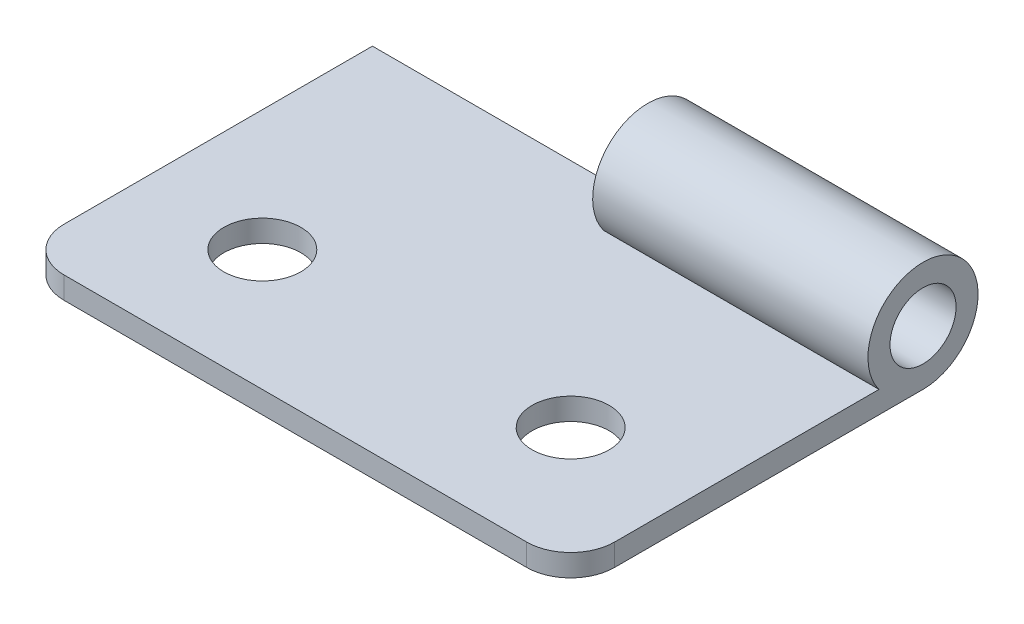
ISO-10303-21;
HEADER;
FILE_DESCRIPTION(('STEP AP214'),'2;1');
FILE_NAME('part.step','',(''),(''),'','','');
FILE_SCHEMA(('AUTOMOTIVE_DESIGN { 1 0 10303 214 1 1 1 1 }'));
ENDSEC;
DATA;
#1=APPLICATION_CONTEXT('core data for automotive mechanical design processes');
#2=APPLICATION_PROTOCOL_DEFINITION('international standard','automotive_design',2000,#1);
#3=PRODUCT_CONTEXT('',#1,'mechanical');
#4=PRODUCT('Part','Part','',(#3));
#5=PRODUCT_RELATED_PRODUCT_CATEGORY('part','',(#4));
#6=PRODUCT_DEFINITION_FORMATION('','',#4);
#7=PRODUCT_DEFINITION_CONTEXT('part definition',#1,'design');
#8=PRODUCT_DEFINITION('design','',#6,#7);
#9=PRODUCT_DEFINITION_SHAPE('','',#8);
#10=(LENGTH_UNIT() NAMED_UNIT(*) SI_UNIT(.MILLI.,.METRE.));
#11=(NAMED_UNIT(*) PLANE_ANGLE_UNIT() SI_UNIT($,.RADIAN.));
#12=(NAMED_UNIT(*) SI_UNIT($,.STERADIAN.) SOLID_ANGLE_UNIT());
#13=UNCERTAINTY_MEASURE_WITH_UNIT(LENGTH_MEASURE(1.E-05),#10,'distance_accuracy_value','');
#14=(GEOMETRIC_REPRESENTATION_CONTEXT(3) GLOBAL_UNCERTAINTY_ASSIGNED_CONTEXT((#13)) GLOBAL_UNIT_ASSIGNED_CONTEXT((#10,
#11,#12)) REPRESENTATION_CONTEXT('',''));
#15=CARTESIAN_POINT('',(0.,0.,0.));
#16=DIRECTION('',(0.,0.,1.));
#17=DIRECTION('',(1.,0.,0.));
#18=AXIS2_PLACEMENT_3D('',#15,#16,#17);
#19=CARTESIAN_POINT('',(-12.5,1.,-8.));
#20=DIRECTION('',(0.,0.,1.));
#21=DIRECTION('',(1.,0.,0.));
#22=AXIS2_PLACEMENT_3D('',#19,#20,#21);
#23=PLANE('',#22);
#24=DIRECTION('',(0.,1.,0.));
#25=VECTOR('',#24,1.);
#26=CARTESIAN_POINT('',(0.,1.,-8.));
#27=LINE('',#26,#25);
#28=CARTESIAN_POINT('',(0.,0.,-8.));
#29=VERTEX_POINT('',#28);
#30=CARTESIAN_POINT('',(0.,1.,-8.));
#31=VERTEX_POINT('',#30);
#32=EDGE_CURVE('E124',#29,#31,#27,.T.);
#33=ORIENTED_EDGE('',*,*,#32,.F.);
#34=DIRECTION('',(-1.,0.,0.));
#35=VECTOR('',#34,1.);
#36=CARTESIAN_POINT('',(-12.5,0.,-8.));
#37=LINE('',#36,#35);
#38=CARTESIAN_POINT('',(-12.5,0.,-8.));
#39=VERTEX_POINT('',#38);
#40=EDGE_CURVE('E108',#29,#39,#37,.T.);
#41=ORIENTED_EDGE('',*,*,#40,.T.);
#42=DIRECTION('',(0.,-1.,0.));
#43=VECTOR('',#42,1.);
#44=CARTESIAN_POINT('',(-12.5,1.,-8.));
#45=LINE('',#44,#43);
#46=CARTESIAN_POINT('',(-12.5,1.,-8.));
#47=VERTEX_POINT('',#46);
#48=EDGE_CURVE('E184',#47,#39,#45,.T.);
#49=ORIENTED_EDGE('',*,*,#48,.F.);
#50=DIRECTION('',(-1.,0.,0.));
#51=VECTOR('',#50,1.);
#52=CARTESIAN_POINT('',(-12.5,1.,-8.));
#53=LINE('',#52,#51);
#54=EDGE_CURVE('E125',#31,#47,#53,.T.);
#55=ORIENTED_EDGE('',*,*,#54,.F.);
#56=EDGE_LOOP('',(#33,#41,#49,#55));
#57=FACE_BOUND('',#56,.T.);
#58=ADVANCED_FACE('F43',(#57),#23,.F.);
#59=CARTESIAN_POINT('',(12.5,1.,-8.));
#60=DIRECTION('',(-1.,0.,0.));
#61=DIRECTION('',(0.,0.,1.));
#62=AXIS2_PLACEMENT_3D('',#59,#60,#61);
#63=PLANE('',#62);
#64=DIRECTION('',(0.,0.,-1.));
#65=VECTOR('',#64,1.);
#66=CARTESIAN_POINT('',(12.5,1.,-8.));
#67=LINE('',#66,#65);
#68=CARTESIAN_POINT('',(12.5,1.,6.));
#69=VERTEX_POINT('',#68);
#70=CARTESIAN_POINT('',(12.5,1.,-6.));
#71=VERTEX_POINT('',#70);
#72=EDGE_CURVE('E172',#69,#71,#67,.T.);
#73=ORIENTED_EDGE('',*,*,#72,.F.);
#74=DIRECTION('',(0.,-1.,0.));
#75=VECTOR('',#74,1.);
#76=CARTESIAN_POINT('',(12.5,1.,6.));
#77=LINE('',#76,#75);
#78=CARTESIAN_POINT('',(12.5,0.,6.));
#79=VERTEX_POINT('',#78);
#80=EDGE_CURVE('E193',#69,#79,#77,.T.);
#81=ORIENTED_EDGE('',*,*,#80,.T.);
#82=DIRECTION('',(0.,0.,-1.));
#83=VECTOR('',#82,1.);
#84=CARTESIAN_POINT('',(12.5,0.,-8.));
#85=LINE('',#84,#83);
#86=CARTESIAN_POINT('',(12.5,0.,-8.));
#87=VERTEX_POINT('',#86);
#88=EDGE_CURVE('E120',#79,#87,#85,.T.);
#89=ORIENTED_EDGE('',*,*,#88,.T.);
#90=CARTESIAN_POINT('',(12.5,2.5,-8.));
#91=DIRECTION('',(1.,0.,0.));
#92=DIRECTION('',(0.,0.,-1.));
#93=AXIS2_PLACEMENT_3D('',#90,#91,#92);
#94=CIRCLE('',#93,2.5);
#95=EDGE_CURVE('E139',#87,#71,#94,.T.);
#96=ORIENTED_EDGE('',*,*,#95,.T.);
#97=EDGE_LOOP('',(#73,#81,#89,#96));
#98=FACE_BOUND('',#97,.T.);
#99=CARTESIAN_POINT('',(12.5,2.5,-8.));
#100=DIRECTION('',(1.,0.,0.));
#101=DIRECTION('',(0.,0.,-1.));
#102=AXIS2_PLACEMENT_3D('',#99,#100,#101);
#103=CIRCLE('',#102,1.5);
#104=CARTESIAN_POINT('',(12.5,2.5,-9.5));
#105=VERTEX_POINT('',#104);
#106=EDGE_CURVE('E151',#105,#105,#103,.T.);
#107=ORIENTED_EDGE('',*,*,#106,.F.);
#108=EDGE_LOOP('',(#107));
#109=FACE_BOUND('',#108,.T.);
#110=ADVANCED_FACE('F220',(#98,#109),#63,.F.);
#111=CARTESIAN_POINT('',(-12.5,1.,-8.));
#112=DIRECTION('',(1.,0.,0.));
#113=DIRECTION('',(0.,0.,-1.));
#114=AXIS2_PLACEMENT_3D('',#111,#112,#113);
#115=PLANE('',#114);
#116=DIRECTION('',(0.,0.,1.));
#117=VECTOR('',#116,1.);
#118=CARTESIAN_POINT('',(-12.5,0.,-8.));
#119=LINE('',#118,#117);
#120=CARTESIAN_POINT('',(-12.5,0.,6.));
#121=VERTEX_POINT('',#120);
#122=EDGE_CURVE('E115',#39,#121,#119,.T.);
#123=ORIENTED_EDGE('',*,*,#122,.T.);
#124=DIRECTION('',(0.,-1.,0.));
#125=VECTOR('',#124,1.);
#126=CARTESIAN_POINT('',(-12.5,1.,6.));
#127=LINE('',#126,#125);
#128=CARTESIAN_POINT('',(-12.5,1.,6.));
#129=VERTEX_POINT('',#128);
#130=EDGE_CURVE('E11',#121,#129,#127,.F.);
#131=ORIENTED_EDGE('',*,*,#130,.T.);
#132=DIRECTION('',(0.,0.,1.));
#133=VECTOR('',#132,1.);
#134=CARTESIAN_POINT('',(-12.5,1.,-8.));
#135=LINE('',#134,#133);
#136=EDGE_CURVE('E178',#47,#129,#135,.T.);
#137=ORIENTED_EDGE('',*,*,#136,.F.);
#138=ORIENTED_EDGE('',*,*,#48,.T.);
#139=EDGE_LOOP('',(#123,#131,#137,#138));
#140=FACE_BOUND('',#139,.T.);
#141=ADVANCED_FACE('F228',(#140),#115,.F.);
#142=CARTESIAN_POINT('',(-12.5,1.,8.));
#143=DIRECTION('',(0.,0.,-1.));
#144=DIRECTION('',(-1.,0.,0.));
#145=AXIS2_PLACEMENT_3D('',#142,#143,#144);
#146=PLANE('',#145);
#147=DIRECTION('',(1.,0.,0.));
#148=VECTOR('',#147,1.);
#149=CARTESIAN_POINT('',(-12.5,0.,8.));
#150=LINE('',#149,#148);
#151=CARTESIAN_POINT('',(-10.5,0.,8.));
#152=VERTEX_POINT('',#151);
#153=CARTESIAN_POINT('',(10.5,0.,8.));
#154=VERTEX_POINT('',#153);
#155=EDGE_CURVE('E175',#152,#154,#150,.T.);
#156=ORIENTED_EDGE('',*,*,#155,.T.);
#157=DIRECTION('',(0.,-1.,0.));
#158=VECTOR('',#157,1.);
#159=CARTESIAN_POINT('',(10.5,1.,8.));
#160=LINE('',#159,#158);
#161=CARTESIAN_POINT('',(10.5,1.,8.));
#162=VERTEX_POINT('',#161);
#163=EDGE_CURVE('E65',#154,#162,#160,.F.);
#164=ORIENTED_EDGE('',*,*,#163,.T.);
#165=DIRECTION('',(1.,0.,0.));
#166=VECTOR('',#165,1.);
#167=CARTESIAN_POINT('',(-12.5,1.,8.));
#168=LINE('',#167,#166);
#169=CARTESIAN_POINT('',(-10.5,1.,8.));
#170=VERTEX_POINT('',#169);
#171=EDGE_CURVE('E181',#170,#162,#168,.T.);
#172=ORIENTED_EDGE('',*,*,#171,.F.);
#173=DIRECTION('',(0.,-1.,0.));
#174=VECTOR('',#173,1.);
#175=CARTESIAN_POINT('',(-10.5,1.,8.));
#176=LINE('',#175,#174);
#177=EDGE_CURVE('E203',#170,#152,#176,.T.);
#178=ORIENTED_EDGE('',*,*,#177,.T.);
#179=EDGE_LOOP('',(#156,#164,#172,#178));
#180=FACE_BOUND('',#179,.T.);
#181=ADVANCED_FACE('F224',(#180),#146,.F.);
#182=CARTESIAN_POINT('',(0.,1.,0.));
#183=DIRECTION('',(0.,1.,0.));
#184=DIRECTION('',(0.,0.,1.));
#185=AXIS2_PLACEMENT_3D('',#182,#183,#184);
#186=PLANE('',#185);
#187=ORIENTED_EDGE('',*,*,#171,.T.);
#188=CARTESIAN_POINT('',(10.5,1.,6.));
#189=DIRECTION('',(0.,1.,0.));
#190=DIRECTION('',(0.,0.,1.));
#191=AXIS2_PLACEMENT_3D('',#188,#189,#190);
#192=CIRCLE('',#191,2.);
#193=EDGE_CURVE('E52',#162,#69,#192,.T.);
#194=ORIENTED_EDGE('',*,*,#193,.T.);
#195=ORIENTED_EDGE('',*,*,#72,.T.);
#196=DIRECTION('',(1.,0.,0.));
#197=VECTOR('',#196,1.);
#198=CARTESIAN_POINT('',(0.,1.,-6.));
#199=LINE('',#198,#197);
#200=CARTESIAN_POINT('',(0.,1.,-6.));
#201=VERTEX_POINT('',#200);
#202=EDGE_CURVE('E130',#201,#71,#199,.T.);
#203=ORIENTED_EDGE('',*,*,#202,.F.);
#204=DIRECTION('',(0.,0.,-1.));
#205=VECTOR('',#204,1.);
#206=CARTESIAN_POINT('',(0.,1.,0.));
#207=LINE('',#206,#205);
#208=EDGE_CURVE('E131',#201,#31,#207,.T.);
#209=ORIENTED_EDGE('',*,*,#208,.T.);
#210=ORIENTED_EDGE('',*,*,#54,.T.);
#211=ORIENTED_EDGE('',*,*,#136,.T.);
#212=CARTESIAN_POINT('',(-10.5,1.,6.));
#213=DIRECTION('',(0.,1.,0.));
#214=DIRECTION('',(0.,0.,1.));
#215=AXIS2_PLACEMENT_3D('',#212,#213,#214);
#216=CIRCLE('',#215,2.);
#217=EDGE_CURVE('E209',#129,#170,#216,.T.);
#218=ORIENTED_EDGE('',*,*,#217,.T.);
#219=EDGE_LOOP('',(#187,#194,#195,#203,#209,#210,#211,#218));
#220=FACE_BOUND('',#219,.T.);
#221=CARTESIAN_POINT('',(7.,1.,2.5));
#222=DIRECTION('',(0.,1.,0.));
#223=DIRECTION('',(0.,0.,1.));
#224=AXIS2_PLACEMENT_3D('',#221,#222,#223);
#225=CIRCLE('',#224,1.75);
#226=CARTESIAN_POINT('',(7.,1.,4.25));
#227=VERTEX_POINT('',#226);
#228=EDGE_CURVE('E161',#227,#227,#225,.T.);
#229=ORIENTED_EDGE('',*,*,#228,.F.);
#230=EDGE_LOOP('',(#229));
#231=FACE_BOUND('',#230,.T.);
#232=CARTESIAN_POINT('',(-7.,1.,2.5));
#233=DIRECTION('',(0.,1.,0.));
#234=DIRECTION('',(0.,0.,1.));
#235=AXIS2_PLACEMENT_3D('',#232,#233,#234);
#236=CIRCLE('',#235,1.75);
#237=CARTESIAN_POINT('',(-7.,1.,4.25));
#238=VERTEX_POINT('',#237);
#239=EDGE_CURVE('E156',#238,#238,#236,.T.);
#240=ORIENTED_EDGE('',*,*,#239,.F.);
#241=EDGE_LOOP('',(#240));
#242=FACE_BOUND('',#241,.T.);
#243=ADVANCED_FACE('F215',(#220,#231,#242),#186,.T.);
#244=CARTESIAN_POINT('',(0.,0.,0.));
#245=DIRECTION('',(0.,1.,0.));
#246=DIRECTION('',(0.,0.,1.));
#247=AXIS2_PLACEMENT_3D('',#244,#245,#246);
#248=PLANE('',#247);
#249=CARTESIAN_POINT('',(7.,0.,2.5));
#250=DIRECTION('',(0.,1.,0.));
#251=DIRECTION('',(0.,0.,1.));
#252=AXIS2_PLACEMENT_3D('',#249,#250,#251);
#253=CIRCLE('',#252,1.75);
#254=CARTESIAN_POINT('',(7.,0.,4.25));
#255=VERTEX_POINT('',#254);
#256=EDGE_CURVE('E157',#255,#255,#253,.T.);
#257=ORIENTED_EDGE('',*,*,#256,.T.);
#258=EDGE_LOOP('',(#257));
#259=FACE_BOUND('',#258,.T.);
#260=CARTESIAN_POINT('',(-7.,0.,2.5));
#261=DIRECTION('',(0.,1.,0.));
#262=DIRECTION('',(0.,0.,1.));
#263=AXIS2_PLACEMENT_3D('',#260,#261,#262);
#264=CIRCLE('',#263,1.75);
#265=CARTESIAN_POINT('',(-7.,0.,4.25));
#266=VERTEX_POINT('',#265);
#267=EDGE_CURVE('E165',#266,#266,#264,.T.);
#268=ORIENTED_EDGE('',*,*,#267,.T.);
#269=EDGE_LOOP('',(#268));
#270=FACE_BOUND('',#269,.T.);
#271=ORIENTED_EDGE('',*,*,#88,.F.);
#272=CARTESIAN_POINT('',(10.5,0.,6.));
#273=DIRECTION('',(0.,1.,0.));
#274=DIRECTION('',(0.,0.,1.));
#275=AXIS2_PLACEMENT_3D('',#272,#273,#274);
#276=CIRCLE('',#275,2.);
#277=EDGE_CURVE('E200',#79,#154,#276,.F.);
#278=ORIENTED_EDGE('',*,*,#277,.T.);
#279=ORIENTED_EDGE('',*,*,#155,.F.);
#280=CARTESIAN_POINT('',(-10.5,0.,6.));
#281=DIRECTION('',(0.,1.,0.));
#282=DIRECTION('',(0.,0.,1.));
#283=AXIS2_PLACEMENT_3D('',#280,#281,#282);
#284=CIRCLE('',#283,2.);
#285=EDGE_CURVE('E197',#152,#121,#284,.F.);
#286=ORIENTED_EDGE('',*,*,#285,.T.);
#287=ORIENTED_EDGE('',*,*,#122,.F.);
#288=ORIENTED_EDGE('',*,*,#40,.F.);
#289=EDGE_CURVE('E113',#87,#29,#37,.T.);
#290=ORIENTED_EDGE('',*,*,#289,.F.);
#291=EDGE_LOOP('',(#271,#278,#279,#286,#287,#288,#290));
#292=FACE_BOUND('',#291,.T.);
#293=ADVANCED_FACE('F111',(#259,#270,#292),#248,.F.);
#294=CARTESIAN_POINT('',(-7.,0.,2.5));
#295=DIRECTION('',(0.,1.,0.));
#296=DIRECTION('',(0.,0.,1.));
#297=AXIS2_PLACEMENT_3D('',#294,#295,#296);
#298=CYLINDRICAL_SURFACE('',#297,1.75);
#299=ORIENTED_EDGE('',*,*,#267,.F.);
#300=EDGE_LOOP('',(#299));
#301=FACE_BOUND('',#300,.T.);
#302=ORIENTED_EDGE('',*,*,#239,.T.);
#303=EDGE_LOOP('',(#302));
#304=FACE_BOUND('',#303,.T.);
#305=ADVANCED_FACE('F261',(#301,#304),#298,.F.);
#306=CARTESIAN_POINT('',(7.,0.,2.5));
#307=DIRECTION('',(0.,1.,0.));
#308=DIRECTION('',(0.,0.,1.));
#309=AXIS2_PLACEMENT_3D('',#306,#307,#308);
#310=CYLINDRICAL_SURFACE('',#309,1.75);
#311=ORIENTED_EDGE('',*,*,#256,.F.);
#312=EDGE_LOOP('',(#311));
#313=FACE_BOUND('',#312,.T.);
#314=ORIENTED_EDGE('',*,*,#228,.T.);
#315=EDGE_LOOP('',(#314));
#316=FACE_BOUND('',#315,.T.);
#317=ADVANCED_FACE('F257',(#313,#316),#310,.F.);
#318=CARTESIAN_POINT('',(0.,2.5,-8.));
#319=DIRECTION('',(1.,0.,0.));
#320=DIRECTION('',(0.,0.,-1.));
#321=AXIS2_PLACEMENT_3D('',#318,#319,#320);
#322=PLANE('',#321);
#323=CARTESIAN_POINT('',(0.,2.5,-8.));
#324=DIRECTION('',(1.,0.,0.));
#325=DIRECTION('',(0.,0.,-1.));
#326=AXIS2_PLACEMENT_3D('',#323,#324,#325);
#327=CIRCLE('',#326,2.5);
#328=EDGE_CURVE('E137',#29,#201,#327,.T.);
#329=ORIENTED_EDGE('',*,*,#328,.F.);
#330=ORIENTED_EDGE('',*,*,#32,.T.);
#331=CARTESIAN_POINT('',(0.,2.5,-8.));
#332=DIRECTION('',(1.,0.,0.));
#333=DIRECTION('',(0.,0.,-1.));
#334=AXIS2_PLACEMENT_3D('',#331,#332,#333);
#335=CIRCLE('',#334,1.5);
#336=EDGE_CURVE('E148',#31,#31,#335,.T.);
#337=ORIENTED_EDGE('',*,*,#336,.T.);
#338=ORIENTED_EDGE('',*,*,#208,.F.);
#339=EDGE_LOOP('',(#329,#330,#337,#338));
#340=FACE_BOUND('',#339,.T.);
#341=ADVANCED_FACE('F142',(#340),#322,.F.);
#342=CARTESIAN_POINT('',(0.,2.5,-8.));
#343=DIRECTION('',(1.,0.,0.));
#344=DIRECTION('',(0.,0.,-1.));
#345=AXIS2_PLACEMENT_3D('',#342,#343,#344);
#346=CYLINDRICAL_SURFACE('',#345,2.5);
#347=ORIENTED_EDGE('',*,*,#328,.T.);
#348=ORIENTED_EDGE('',*,*,#202,.T.);
#349=ORIENTED_EDGE('',*,*,#95,.F.);
#350=ORIENTED_EDGE('',*,*,#289,.T.);
#351=EDGE_LOOP('',(#347,#348,#349,#350));
#352=FACE_BOUND('',#351,.T.);
#353=ADVANCED_FACE('F135',(#352),#346,.T.);
#354=CARTESIAN_POINT('',(0.,2.5,-8.));
#355=DIRECTION('',(1.,0.,0.));
#356=DIRECTION('',(0.,0.,-1.));
#357=AXIS2_PLACEMENT_3D('',#354,#355,#356);
#358=CYLINDRICAL_SURFACE('',#357,1.5);
#359=ORIENTED_EDGE('',*,*,#106,.T.);
#360=EDGE_LOOP('',(#359));
#361=FACE_BOUND('',#360,.T.);
#362=ORIENTED_EDGE('',*,*,#336,.F.);
#363=EDGE_LOOP('',(#362));
#364=FACE_BOUND('',#363,.T.);
#365=ADVANCED_FACE('F242',(#361,#364),#358,.F.);
#366=CARTESIAN_POINT('',(10.5,1.,6.));
#367=DIRECTION('',(0.,-1.,0.));
#368=DIRECTION('',(0.,0.,-1.));
#369=AXIS2_PLACEMENT_3D('',#366,#367,#368);
#370=CYLINDRICAL_SURFACE('',#369,2.);
#371=ORIENTED_EDGE('',*,*,#193,.F.);
#372=ORIENTED_EDGE('',*,*,#163,.F.);
#373=ORIENTED_EDGE('',*,*,#277,.F.);
#374=ORIENTED_EDGE('',*,*,#80,.F.);
#375=EDGE_LOOP('',(#371,#372,#373,#374));
#376=FACE_BOUND('',#375,.T.);
#377=ADVANCED_FACE('F222',(#376),#370,.T.);
#378=CARTESIAN_POINT('',(-10.5,1.,6.));
#379=DIRECTION('',(0.,-1.,0.));
#380=DIRECTION('',(0.,0.,-1.));
#381=AXIS2_PLACEMENT_3D('',#378,#379,#380);
#382=CYLINDRICAL_SURFACE('',#381,2.);
#383=ORIENTED_EDGE('',*,*,#217,.F.);
#384=ORIENTED_EDGE('',*,*,#130,.F.);
#385=ORIENTED_EDGE('',*,*,#285,.F.);
#386=ORIENTED_EDGE('',*,*,#177,.F.);
#387=EDGE_LOOP('',(#383,#384,#385,#386));
#388=FACE_BOUND('',#387,.T.);
#389=ADVANCED_FACE('F45',(#388),#382,.T.);
#390=CLOSED_SHELL('',(#58,#110,#141,#181,#243,#293,#305,#317,#341,#353,#365,#377,#389));
#391=MANIFOLD_SOLID_BREP('B2',#390);
#392=ADVANCED_BREP_SHAPE_REPRESENTATION('',(#18,#391),#14);
#393=SHAPE_DEFINITION_REPRESENTATION(#9,#392);
ENDSEC;
END-ISO-10303-21;
